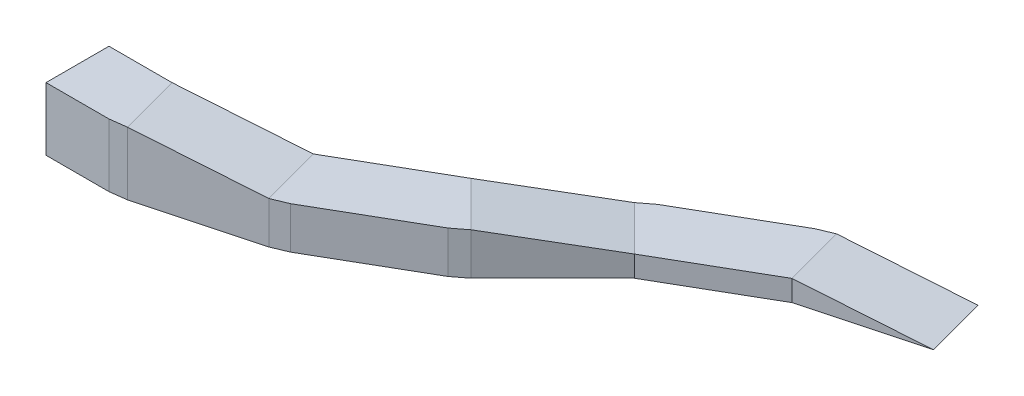
ISO-10303-21;
HEADER;
FILE_DESCRIPTION(('STEP AP214'),'2;1');
FILE_NAME('part.step','',(''),(''),'','','');
FILE_SCHEMA(('AUTOMOTIVE_DESIGN { 1 0 10303 214 1 1 1 1 }'));
ENDSEC;
DATA;
#1=APPLICATION_CONTEXT('core data for automotive mechanical design processes');
#2=APPLICATION_PROTOCOL_DEFINITION('international standard','automotive_design',2000,#1);
#3=PRODUCT_CONTEXT('',#1,'mechanical');
#4=PRODUCT('Part','Part','',(#3));
#5=PRODUCT_RELATED_PRODUCT_CATEGORY('part','',(#4));
#6=PRODUCT_DEFINITION_FORMATION('','',#4);
#7=PRODUCT_DEFINITION_CONTEXT('part definition',#1,'design');
#8=PRODUCT_DEFINITION('design','',#6,#7);
#9=PRODUCT_DEFINITION_SHAPE('','',#8);
#10=(LENGTH_UNIT() NAMED_UNIT(*) SI_UNIT(.MILLI.,.METRE.));
#11=(NAMED_UNIT(*) PLANE_ANGLE_UNIT() SI_UNIT($,.RADIAN.));
#12=(NAMED_UNIT(*) SI_UNIT($,.STERADIAN.) SOLID_ANGLE_UNIT());
#13=UNCERTAINTY_MEASURE_WITH_UNIT(LENGTH_MEASURE(1.E-05),#10,'distance_accuracy_value','');
#14=(GEOMETRIC_REPRESENTATION_CONTEXT(3) GLOBAL_UNCERTAINTY_ASSIGNED_CONTEXT((#13)) GLOBAL_UNIT_ASSIGNED_CONTEXT((#10,
#11,#12)) REPRESENTATION_CONTEXT('',''));
#15=CARTESIAN_POINT('',(0.,0.,0.));
#16=DIRECTION('',(0.,0.,1.));
#17=DIRECTION('',(1.,0.,0.));
#18=AXIS2_PLACEMENT_3D('',#15,#16,#17);
#19=CARTESIAN_POINT('',(-2062.51840891798,-600.,284.700949612766));
#20=DIRECTION('',(0.499999999999995,0.,0.866025403784441));
#21=DIRECTION('',(0.866025403784441,0.,-0.499999999999995));
#22=AXIS2_PLACEMENT_3D('',#19,#20,#21);
#23=PLANE('',#22);
#24=DIRECTION('',(0.,1.,0.));
#25=VECTOR('',#24,1.);
#26=CARTESIAN_POINT('',(-2062.51840891798,-600.,284.700949612766));
#27=LINE('',#26,#25);
#28=CARTESIAN_POINT('',(-2062.51840891798,-600.,284.700949612766));
#29=VERTEX_POINT('',#28);
#30=CARTESIAN_POINT('',(-2062.51840891798,-400.,284.700949612766));
#31=VERTEX_POINT('',#30);
#32=EDGE_CURVE('E43',#29,#31,#27,.T.);
#33=ORIENTED_EDGE('',*,*,#32,.T.);
#34=DIRECTION('',(0.866025403784442,0.,-0.499999999999995));
#35=VECTOR('',#34,1.);
#36=CARTESIAN_POINT('',(-2062.51840891798,-400.,284.700949612766));
#37=LINE('',#36,#35);
#38=CARTESIAN_POINT('',(-3015.14635308086,-400.,834.700949612761));
#39=VERTEX_POINT('',#38);
#40=EDGE_CURVE('E336',#39,#31,#37,.T.);
#41=ORIENTED_EDGE('',*,*,#40,.F.);
#42=DIRECTION('',(0.,1.,0.));
#43=VECTOR('',#42,1.);
#44=CARTESIAN_POINT('',(-3015.14635308086,-600.,834.700949612761));
#45=LINE('',#44,#43);
#46=CARTESIAN_POINT('',(-3015.14635308086,-600.,834.700949612761));
#47=VERTEX_POINT('',#46);
#48=EDGE_CURVE('E134',#47,#39,#45,.T.);
#49=ORIENTED_EDGE('',*,*,#48,.F.);
#50=DIRECTION('',(0.866025403784442,0.,-0.499999999999995));
#51=VECTOR('',#50,1.);
#52=CARTESIAN_POINT('',(-2062.51840891798,-600.,284.700949612766));
#53=LINE('',#52,#51);
#54=EDGE_CURVE('E146',#47,#29,#53,.T.);
#55=ORIENTED_EDGE('',*,*,#54,.T.);
#56=EDGE_LOOP('',(#33,#41,#49,#55));
#57=FACE_BOUND('',#56,.T.);
#58=ADVANCED_FACE('F35',(#57),#23,.T.);
#59=CARTESIAN_POINT('',(-3315.1463530809,-600.,315.085707342127));
#60=DIRECTION('',(-0.608761429008751,0.,-0.793353340291212));
#61=DIRECTION('',(-0.793353340291212,0.,0.608761429008751));
#62=AXIS2_PLACEMENT_3D('',#59,#60,#61);
#63=PLANE('',#62);
#64=DIRECTION('',(0.,1.,0.));
#65=VECTOR('',#64,1.);
#66=CARTESIAN_POINT('',(-3439.41042179279,-600.,410.436880900838));
#67=LINE('',#66,#65);
#68=CARTESIAN_POINT('',(-3439.41042179279,-600.,410.436880900838));
#69=VERTEX_POINT('',#68);
#70=CARTESIAN_POINT('',(-3439.41042179279,-400.,410.436880900831));
#71=VERTEX_POINT('',#70);
#72=EDGE_CURVE('E191',#69,#71,#67,.T.);
#73=ORIENTED_EDGE('',*,*,#72,.T.);
#74=DIRECTION('',(-0.793353340291212,0.,0.608761429008751));
#75=VECTOR('',#74,1.);
#76=CARTESIAN_POINT('',(-3439.41042179279,-400.,410.436880900838));
#77=LINE('',#76,#75);
#78=CARTESIAN_POINT('',(-3315.1463530809,-400.,315.085707342127));
#79=VERTEX_POINT('',#78);
#80=EDGE_CURVE('E330',#79,#71,#77,.T.);
#81=ORIENTED_EDGE('',*,*,#80,.F.);
#82=DIRECTION('',(0.,1.,0.));
#83=VECTOR('',#82,1.);
#84=CARTESIAN_POINT('',(-3315.1463530809,-600.,315.085707342127));
#85=LINE('',#84,#83);
#86=CARTESIAN_POINT('',(-3315.1463530809,-600.,315.085707342127));
#87=VERTEX_POINT('',#86);
#88=EDGE_CURVE('E194',#87,#79,#85,.T.);
#89=ORIENTED_EDGE('',*,*,#88,.F.);
#90=DIRECTION('',(-0.793353340291212,0.,0.608761429008751));
#91=VECTOR('',#90,1.);
#92=CARTESIAN_POINT('',(-3315.1463530809,-600.,315.085707342127));
#93=LINE('',#92,#91);
#94=EDGE_CURVE('E224',#87,#69,#93,.T.);
#95=ORIENTED_EDGE('',*,*,#94,.T.);
#96=EDGE_LOOP('',(#73,#81,#89,#95));
#97=FACE_BOUND('',#96,.T.);
#98=ADVANCED_FACE('F378',(#97),#63,.T.);
#99=CARTESIAN_POINT('',(-2362.51840891798,-600.,-234.914292657897));
#100=DIRECTION('',(-0.5,0.,-0.866025403784438));
#101=DIRECTION('',(-0.866025403784439,0.,0.5));
#102=AXIS2_PLACEMENT_3D('',#99,#100,#101);
#103=PLANE('',#102);
#104=ORIENTED_EDGE('',*,*,#88,.T.);
#105=DIRECTION('',(-0.866025403784438,0.,0.5));
#106=VECTOR('',#105,1.);
#107=CARTESIAN_POINT('',(-3315.1463530809,-400.,315.085707342127));
#108=LINE('',#107,#106);
#109=CARTESIAN_POINT('',(-2362.51840891798,-400.,-234.914292657897));
#110=VERTEX_POINT('',#109);
#111=EDGE_CURVE('E327',#110,#79,#108,.T.);
#112=ORIENTED_EDGE('',*,*,#111,.F.);
#113=DIRECTION('',(0.,1.,0.));
#114=VECTOR('',#113,1.);
#115=CARTESIAN_POINT('',(-2362.51840891798,-600.,-234.914292657897));
#116=LINE('',#115,#114);
#117=CARTESIAN_POINT('',(-2362.51840891798,-600.,-234.914292657897));
#118=VERTEX_POINT('',#117);
#119=EDGE_CURVE('E197',#118,#110,#116,.T.);
#120=ORIENTED_EDGE('',*,*,#119,.F.);
#121=DIRECTION('',(-0.866025403784438,0.,0.5));
#122=VECTOR('',#121,1.);
#123=CARTESIAN_POINT('',(-2362.51840891798,-600.,-234.914292657897));
#124=LINE('',#123,#122);
#125=EDGE_CURVE('E222',#118,#87,#124,.T.);
#126=ORIENTED_EDGE('',*,*,#125,.T.);
#127=EDGE_LOOP('',(#104,#112,#120,#126));
#128=FACE_BOUND('',#127,.T.);
#129=ADVANCED_FACE('F383',(#128),#103,.T.);
#130=CARTESIAN_POINT('',(-2217.80983597949,-600.,-294.854546160674));
#131=DIRECTION('',(-0.382683432365093,0.,-0.923879532511286));
#132=DIRECTION('',(-0.923879532511286,0.,0.382683432365093));
#133=AXIS2_PLACEMENT_3D('',#130,#131,#132);
#134=PLANE('',#133);
#135=ORIENTED_EDGE('',*,*,#119,.T.);
#136=DIRECTION('',(-0.923879532511287,0.,0.382683432365088));
#137=VECTOR('',#136,1.);
#138=CARTESIAN_POINT('',(-2362.51840891798,-400.,-234.914292657897));
#139=LINE('',#138,#137);
#140=CARTESIAN_POINT('',(-2217.80983597949,-400.,-294.854546160676));
#141=VERTEX_POINT('',#140);
#142=EDGE_CURVE('E218',#141,#110,#139,.T.);
#143=ORIENTED_EDGE('',*,*,#142,.F.);
#144=DIRECTION('',(0.,1.,0.));
#145=VECTOR('',#144,1.);
#146=CARTESIAN_POINT('',(-2217.80983597949,-600.,-294.854546160674));
#147=LINE('',#146,#145);
#148=CARTESIAN_POINT('',(-2217.80983597949,-600.,-294.854546160674));
#149=VERTEX_POINT('',#148);
#150=EDGE_CURVE('E159',#149,#141,#147,.T.);
#151=ORIENTED_EDGE('',*,*,#150,.F.);
#152=DIRECTION('',(-0.923879532511286,0.,0.382683432365093));
#153=VECTOR('',#152,1.);
#154=CARTESIAN_POINT('',(-2217.80983597949,-600.,-294.854546160674));
#155=LINE('',#154,#153);
#156=EDGE_CURVE('E216',#149,#118,#155,.T.);
#157=ORIENTED_EDGE('',*,*,#156,.T.);
#158=EDGE_LOOP('',(#135,#143,#151,#157));
#159=FACE_BOUND('',#158,.T.);
#160=ADVANCED_FACE('F215',(#159),#134,.T.);
#161=CARTESIAN_POINT('',(-1000.,-600.,1.22464679914735E-13));
#162=DIRECTION('',(0.258819045102515,0.,0.96592582628907));
#163=DIRECTION('',(0.96592582628907,0.,-0.258819045102515));
#164=AXIS2_PLACEMENT_3D('',#161,#162,#163);
#165=PLANE('',#164);
#166=DIRECTION('',(0.950345355874206,-0.178885438199983,-0.254644270637155));
#167=VECTOR('',#166,1.);
#168=CARTESIAN_POINT('',(-2062.51840891798,-400.,284.700949612766));
#169=LINE('',#168,#167);
#170=CARTESIAN_POINT('',(-1000.,-600.,1.22464679914735E-13));
#171=VERTEX_POINT('',#170);
#172=EDGE_CURVE('E81',#31,#171,#169,.T.);
#173=ORIENTED_EDGE('',*,*,#172,.F.);
#174=ORIENTED_EDGE('',*,*,#32,.F.);
#175=DIRECTION('',(0.96592582628907,0.,-0.258819045102515));
#176=VECTOR('',#175,1.);
#177=CARTESIAN_POINT('',(-1000.,-600.,1.22464679914735E-13));
#178=LINE('',#177,#176);
#179=EDGE_CURVE('E157',#29,#171,#178,.T.);
#180=ORIENTED_EDGE('',*,*,#179,.T.);
#181=EDGE_LOOP('',(#173,#174,#180));
#182=FACE_BOUND('',#181,.T.);
#183=ADVANCED_FACE('F342',(#182),#165,.T.);
#184=CARTESIAN_POINT('',(-3015.14635308086,-600.,834.700949612761));
#185=DIRECTION('',(0.707106781186548,0.,0.707106781186548));
#186=DIRECTION('',(0.707106781186548,0.,-0.707106781186548));
#187=AXIS2_PLACEMENT_3D('',#184,#185,#186);
#188=PLANE('',#187);
#189=DIRECTION('',(0.695701085237043,-0.178885438199983,-0.695701085237044));
#190=VECTOR('',#189,1.);
#191=CARTESIAN_POINT('',(-3792.96381238607,-200.,1612.51840891796));
#192=LINE('',#191,#190);
#193=CARTESIAN_POINT('',(-3792.96381238607,-200.,1612.51840891796));
#194=VERTEX_POINT('',#193);
#195=EDGE_CURVE('E130',#194,#39,#192,.T.);
#196=ORIENTED_EDGE('',*,*,#195,.F.);
#197=DIRECTION('',(0.,1.,0.));
#198=VECTOR('',#197,1.);
#199=CARTESIAN_POINT('',(-3792.96381238607,-600.,1612.51840891796));
#200=LINE('',#199,#198);
#201=CARTESIAN_POINT('',(-3792.96381238607,-600.,1612.51840891796));
#202=VERTEX_POINT('',#201);
#203=EDGE_CURVE('E123',#202,#194,#200,.T.);
#204=ORIENTED_EDGE('',*,*,#203,.F.);
#205=DIRECTION('',(0.707106781186547,0.,-0.707106781186547));
#206=VECTOR('',#205,1.);
#207=CARTESIAN_POINT('',(-3015.14635308086,-600.,834.700949612761));
#208=LINE('',#207,#206);
#209=EDGE_CURVE('E127',#202,#47,#208,.T.);
#210=ORIENTED_EDGE('',*,*,#209,.T.);
#211=ORIENTED_EDGE('',*,*,#48,.T.);
#212=EDGE_LOOP('',(#196,#204,#210,#211));
#213=FACE_BOUND('',#212,.T.);
#214=ADVANCED_FACE('F125',(#213),#188,.T.);
#215=CARTESIAN_POINT('',(-3917.22788109796,-600.,1707.86958247668));
#216=DIRECTION('',(0.60876142900875,0.,0.793353340291213));
#217=DIRECTION('',(0.793353340291213,0.,-0.60876142900875));
#218=AXIS2_PLACEMENT_3D('',#215,#216,#217);
#219=PLANE('',#218);
#220=DIRECTION('',(0.793353340291213,0.,-0.60876142900875));
#221=VECTOR('',#220,1.);
#222=CARTESIAN_POINT('',(-3792.96381238607,-200.,1612.51840891796));
#223=LINE('',#222,#221);
#224=CARTESIAN_POINT('',(-3917.22788109796,-200.,1707.86958247668));
#225=VERTEX_POINT('',#224);
#226=EDGE_CURVE('E316',#225,#194,#223,.T.);
#227=ORIENTED_EDGE('',*,*,#226,.F.);
#228=DIRECTION('',(0.,1.,0.));
#229=VECTOR('',#228,1.);
#230=CARTESIAN_POINT('',(-3917.22788109796,-600.,1707.86958247668));
#231=LINE('',#230,#229);
#232=CARTESIAN_POINT('',(-3917.22788109796,-600.,1707.86958247668));
#233=VERTEX_POINT('',#232);
#234=EDGE_CURVE('E135',#233,#225,#231,.T.);
#235=ORIENTED_EDGE('',*,*,#234,.F.);
#236=DIRECTION('',(0.793353340291213,0.,-0.60876142900875));
#237=VECTOR('',#236,1.);
#238=CARTESIAN_POINT('',(-3917.22788109796,-600.,1707.86958247668));
#239=LINE('',#238,#237);
#240=EDGE_CURVE('E143',#233,#202,#239,.T.);
#241=ORIENTED_EDGE('',*,*,#240,.T.);
#242=ORIENTED_EDGE('',*,*,#203,.T.);
#243=EDGE_LOOP('',(#227,#235,#241,#242));
#244=FACE_BOUND('',#243,.T.);
#245=ADVANCED_FACE('F148',(#244),#219,.T.);
#246=CARTESIAN_POINT('',(-4869.85582526088,-600.,2257.8695824767));
#247=DIRECTION('',(0.5,0.,0.866025403784439));
#248=DIRECTION('',(0.866025403784439,0.,-0.5));
#249=AXIS2_PLACEMENT_3D('',#246,#247,#248);
#250=PLANE('',#249);
#251=DIRECTION('',(0.866025403784439,0.,-0.5));
#252=VECTOR('',#251,1.);
#253=CARTESIAN_POINT('',(-3917.22788109796,-200.,1707.86958247668));
#254=LINE('',#253,#252);
#255=CARTESIAN_POINT('',(-4869.85582526088,-200.,2257.8695824767));
#256=VERTEX_POINT('',#255);
#257=EDGE_CURVE('E313',#256,#225,#254,.T.);
#258=ORIENTED_EDGE('',*,*,#257,.F.);
#259=DIRECTION('',(0.,1.,0.));
#260=VECTOR('',#259,1.);
#261=CARTESIAN_POINT('',(-4869.85582526088,-600.,2257.8695824767));
#262=LINE('',#261,#260);
#263=CARTESIAN_POINT('',(-4869.85582526088,-600.,2257.8695824767));
#264=VERTEX_POINT('',#263);
#265=EDGE_CURVE('E171',#264,#256,#262,.T.);
#266=ORIENTED_EDGE('',*,*,#265,.F.);
#267=DIRECTION('',(0.866025403784439,0.,-0.5));
#268=VECTOR('',#267,1.);
#269=CARTESIAN_POINT('',(-4869.85582526088,-600.,2257.8695824767));
#270=LINE('',#269,#268);
#271=EDGE_CURVE('E150',#264,#233,#270,.T.);
#272=ORIENTED_EDGE('',*,*,#271,.T.);
#273=ORIENTED_EDGE('',*,*,#234,.T.);
#274=EDGE_LOOP('',(#258,#266,#272,#273));
#275=FACE_BOUND('',#274,.T.);
#276=ADVANCED_FACE('F393',(#275),#250,.T.);
#277=CARTESIAN_POINT('',(-5014.56439819936,-600.,2317.80983597948));
#278=DIRECTION('',(0.38268343236509,0.,0.923879532511286));
#279=DIRECTION('',(0.923879532511287,0.,-0.382683432365091));
#280=AXIS2_PLACEMENT_3D('',#277,#278,#279);
#281=PLANE('',#280);
#282=DIRECTION('',(0.923879532511286,0.,-0.38268343236509));
#283=VECTOR('',#282,1.);
#284=CARTESIAN_POINT('',(-4869.85582526088,-200.,2257.8695824767));
#285=LINE('',#284,#283);
#286=CARTESIAN_POINT('',(-5014.56439819936,-200.,2317.80983597948));
#287=VERTEX_POINT('',#286);
#288=EDGE_CURVE('E310',#287,#256,#285,.T.);
#289=ORIENTED_EDGE('',*,*,#288,.F.);
#290=DIRECTION('',(0.,1.,0.));
#291=VECTOR('',#290,1.);
#292=CARTESIAN_POINT('',(-5014.56439819936,-600.,2317.80983597948));
#293=LINE('',#292,#291);
#294=CARTESIAN_POINT('',(-5014.56439819936,-600.,2317.80983597948));
#295=VERTEX_POINT('',#294);
#296=EDGE_CURVE('E174',#295,#287,#293,.T.);
#297=ORIENTED_EDGE('',*,*,#296,.F.);
#298=DIRECTION('',(0.923879532511286,0.,-0.38268343236509));
#299=VECTOR('',#298,1.);
#300=CARTESIAN_POINT('',(-5014.56439819936,-600.,2317.80983597948));
#301=LINE('',#300,#299);
#302=EDGE_CURVE('E152',#295,#264,#301,.T.);
#303=ORIENTED_EDGE('',*,*,#302,.T.);
#304=ORIENTED_EDGE('',*,*,#265,.T.);
#305=EDGE_LOOP('',(#289,#297,#303,#304));
#306=FACE_BOUND('',#305,.T.);
#307=ADVANCED_FACE('F254',(#306),#281,.T.);
#308=CARTESIAN_POINT('',(-6077.08280711734,-600.,2602.51078559224));
#309=DIRECTION('',(0.258819045102514,0.,0.96592582628907));
#310=DIRECTION('',(0.96592582628907,0.,-0.258819045102514));
#311=AXIS2_PLACEMENT_3D('',#308,#309,#310);
#312=PLANE('',#311);
#313=DIRECTION('',(0.950345355874206,-0.178885438199984,-0.254644270637155));
#314=VECTOR('',#313,1.);
#315=CARTESIAN_POINT('',(-5014.56439819936,-200.,2317.80983597948));
#316=LINE('',#315,#314);
#317=CARTESIAN_POINT('',(-6077.08280711734,0.,2602.51078559224));
#318=VERTEX_POINT('',#317);
#319=EDGE_CURVE('E264',#318,#287,#316,.T.);
#320=ORIENTED_EDGE('',*,*,#319,.F.);
#321=DIRECTION('',(0.,1.,0.));
#322=VECTOR('',#321,1.);
#323=CARTESIAN_POINT('',(-6077.08280711734,-600.,2602.51078559224));
#324=LINE('',#323,#322);
#325=CARTESIAN_POINT('',(-6077.08280711734,-600.,2602.51078559224));
#326=VERTEX_POINT('',#325);
#327=EDGE_CURVE('E177',#326,#318,#324,.T.);
#328=ORIENTED_EDGE('',*,*,#327,.F.);
#329=DIRECTION('',(0.96592582628907,0.,-0.258819045102514));
#330=VECTOR('',#329,1.);
#331=CARTESIAN_POINT('',(-6077.08280711734,-600.,2602.51078559224));
#332=LINE('',#331,#330);
#333=EDGE_CURVE('E248',#326,#295,#332,.T.);
#334=ORIENTED_EDGE('',*,*,#333,.T.);
#335=ORIENTED_EDGE('',*,*,#296,.T.);
#336=EDGE_LOOP('',(#320,#328,#334,#335));
#337=FACE_BOUND('',#336,.T.);
#338=ADVANCED_FACE('F260',(#337),#312,.T.);
#339=CARTESIAN_POINT('',(-6232.37423417885,-600.,2622.9552898188));
#340=DIRECTION('',(0.130526192220058,0.,0.99144486137381));
#341=DIRECTION('',(0.99144486137381,0.,-0.130526192220058));
#342=AXIS2_PLACEMENT_3D('',#339,#340,#341);
#343=PLANE('',#342);
#344=DIRECTION('',(0.99144486137381,0.,-0.130526192220058));
#345=VECTOR('',#344,1.);
#346=CARTESIAN_POINT('',(-6232.37423417885,0.,2622.9552898188));
#347=LINE('',#346,#345);
#348=CARTESIAN_POINT('',(-6232.37423417885,0.,2622.9552898188));
#349=VERTEX_POINT('',#348);
#350=EDGE_CURVE('E165',#349,#318,#347,.T.);
#351=ORIENTED_EDGE('',*,*,#350,.F.);
#352=DIRECTION('',(0.,1.,0.));
#353=VECTOR('',#352,1.);
#354=CARTESIAN_POINT('',(-6232.37423417885,-600.,2622.9552898188));
#355=LINE('',#354,#353);
#356=CARTESIAN_POINT('',(-6232.37423417885,-600.,2622.9552898188));
#357=VERTEX_POINT('',#356);
#358=EDGE_CURVE('E180',#357,#349,#355,.T.);
#359=ORIENTED_EDGE('',*,*,#358,.F.);
#360=DIRECTION('',(0.99144486137381,0.,-0.130526192220058));
#361=VECTOR('',#360,1.);
#362=CARTESIAN_POINT('',(-6232.37423417885,-600.,2622.9552898188));
#363=LINE('',#362,#361);
#364=EDGE_CURVE('E245',#357,#326,#363,.T.);
#365=ORIENTED_EDGE('',*,*,#364,.T.);
#366=ORIENTED_EDGE('',*,*,#327,.T.);
#367=EDGE_LOOP('',(#351,#359,#365,#366));
#368=FACE_BOUND('',#367,.T.);
#369=ADVANCED_FACE('F267',(#368),#343,.T.);
#370=CARTESIAN_POINT('',(-7232.37423417885,-600.,2622.9552898188));
#371=DIRECTION('',(0.,0.,1.));
#372=DIRECTION('',(1.,0.,0.));
#373=AXIS2_PLACEMENT_3D('',#370,#371,#372);
#374=PLANE('',#373);
#375=DIRECTION('',(0.,1.,0.));
#376=VECTOR('',#375,1.);
#377=CARTESIAN_POINT('',(-6832.37423417885,-600.,2622.9552898188));
#378=LINE('',#377,#376);
#379=CARTESIAN_POINT('',(-6832.37423417885,-600.,2622.9552898188));
#380=VERTEX_POINT('',#379);
#381=CARTESIAN_POINT('',(-6832.37423417885,0.,2622.9552898188));
#382=VERTEX_POINT('',#381);
#383=EDGE_CURVE('E49',#380,#382,#378,.T.);
#384=ORIENTED_EDGE('',*,*,#383,.F.);
#385=DIRECTION('',(1.,0.,0.));
#386=VECTOR('',#385,1.);
#387=CARTESIAN_POINT('',(-7232.37423417885,-600.,2622.9552898188));
#388=LINE('',#387,#386);
#389=EDGE_CURVE('E243',#380,#357,#388,.T.);
#390=ORIENTED_EDGE('',*,*,#389,.T.);
#391=ORIENTED_EDGE('',*,*,#358,.T.);
#392=DIRECTION('',(1.,0.,0.));
#393=VECTOR('',#392,1.);
#394=CARTESIAN_POINT('',(-7232.37423417885,0.,2622.9552898188));
#395=LINE('',#394,#393);
#396=EDGE_CURVE('E70',#382,#349,#395,.T.);
#397=ORIENTED_EDGE('',*,*,#396,.F.);
#398=EDGE_LOOP('',(#384,#390,#391,#397));
#399=FACE_BOUND('',#398,.T.);
#400=ADVANCED_FACE('F367',(#399),#374,.T.);
#401=CARTESIAN_POINT('',(-7232.37423417885,-600.,2022.9552898188));
#402=DIRECTION('',(0.,0.,-1.));
#403=DIRECTION('',(-1.,0.,0.));
#404=AXIS2_PLACEMENT_3D('',#401,#402,#403);
#405=PLANE('',#404);
#406=DIRECTION('',(0.,-1.,0.));
#407=VECTOR('',#406,1.);
#408=CARTESIAN_POINT('',(-6832.37423417885,-600.,2022.9552898188));
#409=LINE('',#408,#407);
#410=CARTESIAN_POINT('',(-6832.37423417885,0.,2022.9552898188));
#411=VERTEX_POINT('',#410);
#412=CARTESIAN_POINT('',(-6832.37423417885,-600.,2022.9552898188));
#413=VERTEX_POINT('',#412);
#414=EDGE_CURVE('E294',#411,#413,#409,.T.);
#415=ORIENTED_EDGE('',*,*,#414,.F.);
#416=DIRECTION('',(-1.,0.,0.));
#417=VECTOR('',#416,1.);
#418=CARTESIAN_POINT('',(-7232.37423417885,0.,2022.9552898188));
#419=LINE('',#418,#417);
#420=CARTESIAN_POINT('',(-6232.37423417885,0.,2022.9552898188));
#421=VERTEX_POINT('',#420);
#422=EDGE_CURVE('E160',#421,#411,#419,.T.);
#423=ORIENTED_EDGE('',*,*,#422,.F.);
#424=DIRECTION('',(0.,1.,0.));
#425=VECTOR('',#424,1.);
#426=CARTESIAN_POINT('',(-6232.37423417885,-600.,2022.9552898188));
#427=LINE('',#426,#425);
#428=CARTESIAN_POINT('',(-6232.37423417885,-600.,2022.9552898188));
#429=VERTEX_POINT('',#428);
#430=EDGE_CURVE('E182',#429,#421,#427,.T.);
#431=ORIENTED_EDGE('',*,*,#430,.F.);
#432=DIRECTION('',(-1.,0.,0.));
#433=VECTOR('',#432,1.);
#434=CARTESIAN_POINT('',(-7232.37423417885,-600.,2022.9552898188));
#435=LINE('',#434,#433);
#436=EDGE_CURVE('E240',#429,#413,#435,.T.);
#437=ORIENTED_EDGE('',*,*,#436,.T.);
#438=EDGE_LOOP('',(#415,#423,#431,#437));
#439=FACE_BOUND('',#438,.T.);
#440=ADVANCED_FACE('F292',(#439),#405,.T.);
#441=CARTESIAN_POINT('',(-6232.37423417885,-600.,2022.9552898188));
#442=DIRECTION('',(-0.258819045102515,0.,-0.96592582628907));
#443=DIRECTION('',(-0.96592582628907,0.,0.258819045102515));
#444=AXIS2_PLACEMENT_3D('',#441,#442,#443);
#445=PLANE('',#444);
#446=DIRECTION('',(-0.950345355874206,0.178885438199984,0.254644270637155));
#447=VECTOR('',#446,1.);
#448=CARTESIAN_POINT('',(-6130.37246692273,-19.1999999999988,1995.62399865598));
#449=LINE('',#448,#447);
#450=CARTESIAN_POINT('',(-5169.85582526088,-200.,1738.25434020601));
#451=VERTEX_POINT('',#450);
#452=EDGE_CURVE('E282',#451,#421,#449,.T.);
#453=ORIENTED_EDGE('',*,*,#452,.F.);
#454=DIRECTION('',(0.,1.,0.));
#455=VECTOR('',#454,1.);
#456=CARTESIAN_POINT('',(-5169.85582526088,-600.,1738.25434020604));
#457=LINE('',#456,#455);
#458=CARTESIAN_POINT('',(-5169.85582526088,-600.,1738.25434020604));
#459=VERTEX_POINT('',#458);
#460=EDGE_CURVE('E185',#459,#451,#457,.T.);
#461=ORIENTED_EDGE('',*,*,#460,.F.);
#462=DIRECTION('',(-0.96592582628907,0.,0.258819045102515));
#463=VECTOR('',#462,1.);
#464=CARTESIAN_POINT('',(-6232.37423417885,-600.,2022.9552898188));
#465=LINE('',#464,#463);
#466=EDGE_CURVE('E237',#459,#429,#465,.T.);
#467=ORIENTED_EDGE('',*,*,#466,.T.);
#468=ORIENTED_EDGE('',*,*,#430,.T.);
#469=EDGE_LOOP('',(#453,#461,#467,#468));
#470=FACE_BOUND('',#469,.T.);
#471=ADVANCED_FACE('F286',(#470),#445,.T.);
#472=CARTESIAN_POINT('',(-5169.85582526088,-600.,1738.25434020604));
#473=DIRECTION('',(-0.5,0.,-0.866025403784438));
#474=DIRECTION('',(-0.866025403784439,0.,0.5));
#475=AXIS2_PLACEMENT_3D('',#472,#473,#474);
#476=PLANE('',#475);
#477=DIRECTION('',(-0.866025403784439,0.,0.5));
#478=VECTOR('',#477,1.);
#479=CARTESIAN_POINT('',(-5169.85582526088,-200.,1738.25434020604));
#480=LINE('',#479,#478);
#481=CARTESIAN_POINT('',(-4217.22788109799,-200.,1188.25434020604));
#482=VERTEX_POINT('',#481);
#483=EDGE_CURVE('E305',#482,#451,#480,.T.);
#484=ORIENTED_EDGE('',*,*,#483,.F.);
#485=DIRECTION('',(0.,1.,0.));
#486=VECTOR('',#485,1.);
#487=CARTESIAN_POINT('',(-4217.227881098,-600.,1188.25434020604));
#488=LINE('',#487,#486);
#489=CARTESIAN_POINT('',(-4217.227881098,-600.,1188.25434020604));
#490=VERTEX_POINT('',#489);
#491=EDGE_CURVE('E188',#490,#482,#488,.T.);
#492=ORIENTED_EDGE('',*,*,#491,.F.);
#493=DIRECTION('',(-0.866025403784438,0.,0.5));
#494=VECTOR('',#493,1.);
#495=CARTESIAN_POINT('',(-5169.85582526088,-600.,1738.25434020604));
#496=LINE('',#495,#494);
#497=EDGE_CURVE('E234',#490,#459,#496,.T.);
#498=ORIENTED_EDGE('',*,*,#497,.T.);
#499=ORIENTED_EDGE('',*,*,#460,.T.);
#500=EDGE_LOOP('',(#484,#492,#498,#499));
#501=FACE_BOUND('',#500,.T.);
#502=ADVANCED_FACE('F427',(#501),#476,.T.);
#503=CARTESIAN_POINT('',(-3439.41042179279,-600.,410.436880900838));
#504=DIRECTION('',(-0.707106781186544,0.,-0.707106781186551));
#505=DIRECTION('',(-0.707106781186551,0.,0.707106781186544));
#506=AXIS2_PLACEMENT_3D('',#503,#504,#505);
#507=PLANE('',#506);
#508=DIRECTION('',(0.695701085237043,-0.178885438199983,-0.695701085237044));
#509=VECTOR('',#508,1.);
#510=CARTESIAN_POINT('',(-4217.22788109799,-200.,1188.25434020604));
#511=LINE('',#510,#509);
#512=EDGE_CURVE('E319',#482,#71,#511,.T.);
#513=ORIENTED_EDGE('',*,*,#512,.T.);
#514=ORIENTED_EDGE('',*,*,#72,.F.);
#515=DIRECTION('',(-0.707106781186551,0.,0.707106781186544));
#516=VECTOR('',#515,1.);
#517=CARTESIAN_POINT('',(-3439.41042179279,-600.,410.436880900838));
#518=LINE('',#517,#516);
#519=EDGE_CURVE('E231',#69,#490,#518,.T.);
#520=ORIENTED_EDGE('',*,*,#519,.T.);
#521=ORIENTED_EDGE('',*,*,#491,.T.);
#522=EDGE_LOOP('',(#513,#514,#520,#521));
#523=FACE_BOUND('',#522,.T.);
#524=ADVANCED_FACE('F434',(#523),#507,.T.);
#525=CARTESIAN_POINT('',(-1155.29142706151,-600.,-579.55549577344));
#526=DIRECTION('',(-0.258819045102515,0.,-0.96592582628907));
#527=DIRECTION('',(-0.96592582628907,0.,0.258819045102515));
#528=AXIS2_PLACEMENT_3D('',#525,#526,#527);
#529=PLANE('',#528);
#530=DIRECTION('',(0.950345355874206,-0.178885438199983,-0.254644270637155));
#531=VECTOR('',#530,1.);
#532=CARTESIAN_POINT('',(-2217.80983597949,-400.,-294.854546160676));
#533=LINE('',#532,#531);
#534=CARTESIAN_POINT('',(-1155.29142706151,-600.,-579.555495773442));
#535=VERTEX_POINT('',#534);
#536=EDGE_CURVE('E205',#141,#535,#533,.T.);
#537=ORIENTED_EDGE('',*,*,#536,.T.);
#538=DIRECTION('',(-0.96592582628907,0.,0.258819045102515));
#539=VECTOR('',#538,1.);
#540=CARTESIAN_POINT('',(-1155.29142706151,-600.,-579.55549577344));
#541=LINE('',#540,#539);
#542=EDGE_CURVE('E167',#535,#149,#541,.T.);
#543=ORIENTED_EDGE('',*,*,#542,.T.);
#544=ORIENTED_EDGE('',*,*,#150,.T.);
#545=EDGE_LOOP('',(#537,#543,#544));
#546=FACE_BOUND('',#545,.T.);
#547=ADVANCED_FACE('F37',(#546),#529,.T.);
#548=CARTESIAN_POINT('',(0.,-600.,0.));
#549=DIRECTION('',(0.,1.,0.));
#550=DIRECTION('',(0.,0.,1.));
#551=AXIS2_PLACEMENT_3D('',#548,#549,#550);
#552=PLANE('',#551);
#553=ORIENTED_EDGE('',*,*,#389,.F.);
#554=DIRECTION('',(0.,0.,-1.));
#555=VECTOR('',#554,1.);
#556=CARTESIAN_POINT('',(-6832.37423417885,-600.,0.));
#557=LINE('',#556,#555);
#558=EDGE_CURVE('E299',#380,#413,#557,.T.);
#559=ORIENTED_EDGE('',*,*,#558,.T.);
#560=ORIENTED_EDGE('',*,*,#436,.F.);
#561=ORIENTED_EDGE('',*,*,#466,.F.);
#562=ORIENTED_EDGE('',*,*,#497,.F.);
#563=ORIENTED_EDGE('',*,*,#519,.F.);
#564=ORIENTED_EDGE('',*,*,#94,.F.);
#565=ORIENTED_EDGE('',*,*,#125,.F.);
#566=ORIENTED_EDGE('',*,*,#156,.F.);
#567=ORIENTED_EDGE('',*,*,#542,.F.);
#568=DIRECTION('',(0.258819045102524,0.,0.965925826289067));
#569=VECTOR('',#568,1.);
#570=CARTESIAN_POINT('',(-1155.29142706151,-600.,-579.55549577344));
#571=LINE('',#570,#569);
#572=EDGE_CURVE('E163',#535,#171,#571,.T.);
#573=ORIENTED_EDGE('',*,*,#572,.T.);
#574=ORIENTED_EDGE('',*,*,#179,.F.);
#575=ORIENTED_EDGE('',*,*,#54,.F.);
#576=ORIENTED_EDGE('',*,*,#209,.F.);
#577=ORIENTED_EDGE('',*,*,#240,.F.);
#578=ORIENTED_EDGE('',*,*,#271,.F.);
#579=ORIENTED_EDGE('',*,*,#302,.F.);
#580=ORIENTED_EDGE('',*,*,#333,.F.);
#581=ORIENTED_EDGE('',*,*,#364,.F.);
#582=EDGE_LOOP('',(#553,#559,#560,#561,#562,#563,#564,#565,#566,#567,#573,#574,#575,#576,#577,
#578,#579,#580,#581));
#583=FACE_BOUND('',#582,.T.);
#584=ADVANCED_FACE('F141',(#583),#552,.F.);
#585=CARTESIAN_POINT('',(0.,0.,0.));
#586=DIRECTION('',(0.,1.,0.));
#587=DIRECTION('',(0.,0.,1.));
#588=AXIS2_PLACEMENT_3D('',#585,#586,#587);
#589=PLANE('',#588);
#590=DIRECTION('',(0.,0.,-1.));
#591=VECTOR('',#590,1.);
#592=CARTESIAN_POINT('',(-6832.37423417885,0.,0.));
#593=LINE('',#592,#591);
#594=EDGE_CURVE('E11',#382,#411,#593,.T.);
#595=ORIENTED_EDGE('',*,*,#594,.F.);
#596=ORIENTED_EDGE('',*,*,#396,.T.);
#597=ORIENTED_EDGE('',*,*,#350,.T.);
#598=DIRECTION('',(0.258819045102514,0.,0.96592582628907));
#599=VECTOR('',#598,1.);
#600=CARTESIAN_POINT('',(-7629.99707773242,0.,-3193.04417214218));
#601=LINE('',#600,#599);
#602=EDGE_CURVE('E275',#421,#318,#601,.T.);
#603=ORIENTED_EDGE('',*,*,#602,.F.);
#604=ORIENTED_EDGE('',*,*,#422,.T.);
#605=EDGE_LOOP('',(#595,#596,#597,#603,#604));
#606=FACE_BOUND('',#605,.T.);
#607=ADVANCED_FACE('F274',(#606),#589,.T.);
#608=CARTESIAN_POINT('',(-2217.80983597949,-400.,-294.854546160676));
#609=DIRECTION('',(-0.172790064704401,-0.983869910099907,0.0462989582976646));
#610=DIRECTION('',(0.984926117053838,-0.172975558808893,0.));
#611=AXIS2_PLACEMENT_3D('',#608,#609,#610);
#612=PLANE('',#611);
#613=ORIENTED_EDGE('',*,*,#172,.T.);
#614=ORIENTED_EDGE('',*,*,#572,.F.);
#615=ORIENTED_EDGE('',*,*,#536,.F.);
#616=DIRECTION('',(0.258819045102515,0.,0.96592582628907));
#617=VECTOR('',#616,1.);
#618=CARTESIAN_POINT('',(-2217.80983597949,-400.,-294.854546160676));
#619=LINE('',#618,#617);
#620=EDGE_CURVE('E340',#141,#31,#619,.T.);
#621=ORIENTED_EDGE('',*,*,#620,.T.);
#622=EDGE_LOOP('',(#613,#614,#615,#621));
#623=FACE_BOUND('',#622,.T.);
#624=ADVANCED_FACE('F467',(#623),#612,.F.);
#625=CARTESIAN_POINT('',(0.,-400.,0.));
#626=DIRECTION('',(0.,1.,0.));
#627=DIRECTION('',(0.,0.,1.));
#628=AXIS2_PLACEMENT_3D('',#625,#626,#627);
#629=PLANE('',#628);
#630=ORIENTED_EDGE('',*,*,#620,.F.);
#631=ORIENTED_EDGE('',*,*,#142,.T.);
#632=ORIENTED_EDGE('',*,*,#111,.T.);
#633=ORIENTED_EDGE('',*,*,#80,.T.);
#634=DIRECTION('',(0.70710678118655,0.,0.707106781186545));
#635=VECTOR('',#634,1.);
#636=CARTESIAN_POINT('',(-3015.14635308086,-400.,834.700949612761));
#637=LINE('',#636,#635);
#638=EDGE_CURVE('E333',#71,#39,#637,.T.);
#639=ORIENTED_EDGE('',*,*,#638,.T.);
#640=ORIENTED_EDGE('',*,*,#40,.T.);
#641=EDGE_LOOP('',(#630,#631,#632,#633,#639,#640));
#642=FACE_BOUND('',#641,.T.);
#643=ADVANCED_FACE('F475',(#642),#629,.T.);
#644=CARTESIAN_POINT('',(-4217.22788109799,-200.,1188.25434020604));
#645=DIRECTION('',(-0.126491106406735,-0.983869910099908,0.126491106406735));
#646=DIRECTION('',(0.,-0.127515342612667,-0.991836598134175));
#647=AXIS2_PLACEMENT_3D('',#644,#645,#646);
#648=PLANE('',#647);
#649=ORIENTED_EDGE('',*,*,#195,.T.);
#650=ORIENTED_EDGE('',*,*,#638,.F.);
#651=ORIENTED_EDGE('',*,*,#512,.F.);
#652=DIRECTION('',(0.707106781186548,0.,0.707106781186547));
#653=VECTOR('',#652,1.);
#654=CARTESIAN_POINT('',(-4217.22788109799,-200.,1188.25434020604));
#655=LINE('',#654,#653);
#656=EDGE_CURVE('E322',#482,#194,#655,.T.);
#657=ORIENTED_EDGE('',*,*,#656,.T.);
#658=EDGE_LOOP('',(#649,#650,#651,#657));
#659=FACE_BOUND('',#658,.T.);
#660=ADVANCED_FACE('F481',(#659),#648,.F.);
#661=CARTESIAN_POINT('',(0.,-200.,0.));
#662=DIRECTION('',(0.,-1.,0.));
#663=DIRECTION('',(0.,0.,-1.));
#664=AXIS2_PLACEMENT_3D('',#661,#662,#663);
#665=PLANE('',#664);
#666=ORIENTED_EDGE('',*,*,#483,.T.);
#667=DIRECTION('',(0.258819045102524,0.,0.965925826289068));
#668=VECTOR('',#667,1.);
#669=CARTESIAN_POINT('',(-5014.56439819936,-200.,2317.80983597948));
#670=LINE('',#669,#668);
#671=EDGE_CURVE('E307',#451,#287,#670,.T.);
#672=ORIENTED_EDGE('',*,*,#671,.T.);
#673=ORIENTED_EDGE('',*,*,#288,.T.);
#674=ORIENTED_EDGE('',*,*,#257,.T.);
#675=ORIENTED_EDGE('',*,*,#226,.T.);
#676=ORIENTED_EDGE('',*,*,#656,.F.);
#677=EDGE_LOOP('',(#666,#672,#673,#674,#675,#676));
#678=FACE_BOUND('',#677,.T.);
#679=ADVANCED_FACE('F490',(#678),#665,.F.);
#680=CARTESIAN_POINT('',(-6567.47866881445,-200.,-3477.74512175494));
#681=DIRECTION('',(-0.172790064704401,-0.983869910099907,0.0462989582976645));
#682=DIRECTION('',(0.984926117053838,-0.172975558808894,0.));
#683=AXIS2_PLACEMENT_3D('',#680,#681,#682);
#684=PLANE('',#683);
#685=ORIENTED_EDGE('',*,*,#452,.T.);
#686=ORIENTED_EDGE('',*,*,#602,.T.);
#687=ORIENTED_EDGE('',*,*,#319,.T.);
#688=ORIENTED_EDGE('',*,*,#671,.F.);
#689=EDGE_LOOP('',(#685,#686,#687,#688));
#690=FACE_BOUND('',#689,.T.);
#691=ADVANCED_FACE('F496',(#690),#684,.F.);
#692=CARTESIAN_POINT('',(-6832.37423417885,0.,0.));
#693=DIRECTION('',(1.,0.,0.));
#694=DIRECTION('',(0.,0.,-1.));
#695=AXIS2_PLACEMENT_3D('',#692,#693,#694);
#696=PLANE('',#695);
#697=ORIENTED_EDGE('',*,*,#383,.T.);
#698=ORIENTED_EDGE('',*,*,#594,.T.);
#699=ORIENTED_EDGE('',*,*,#414,.T.);
#700=ORIENTED_EDGE('',*,*,#558,.F.);
#701=EDGE_LOOP('',(#697,#698,#699,#700));
#702=FACE_BOUND('',#701,.T.);
#703=ADVANCED_FACE('F365',(#702),#696,.F.);
#704=CLOSED_SHELL('',(#58,#98,#129,#160,#183,#214,#245,#276,#307,#338,#369,#400,#440,#471,#502,
#524,#547,#584,#607,#624,#643,#660,#679,#691,#703));
#705=MANIFOLD_SOLID_BREP('B2',#704);
#706=ADVANCED_BREP_SHAPE_REPRESENTATION('',(#18,#705),#14);
#707=SHAPE_DEFINITION_REPRESENTATION(#9,#706);
ENDSEC;
END-ISO-10303-21;
